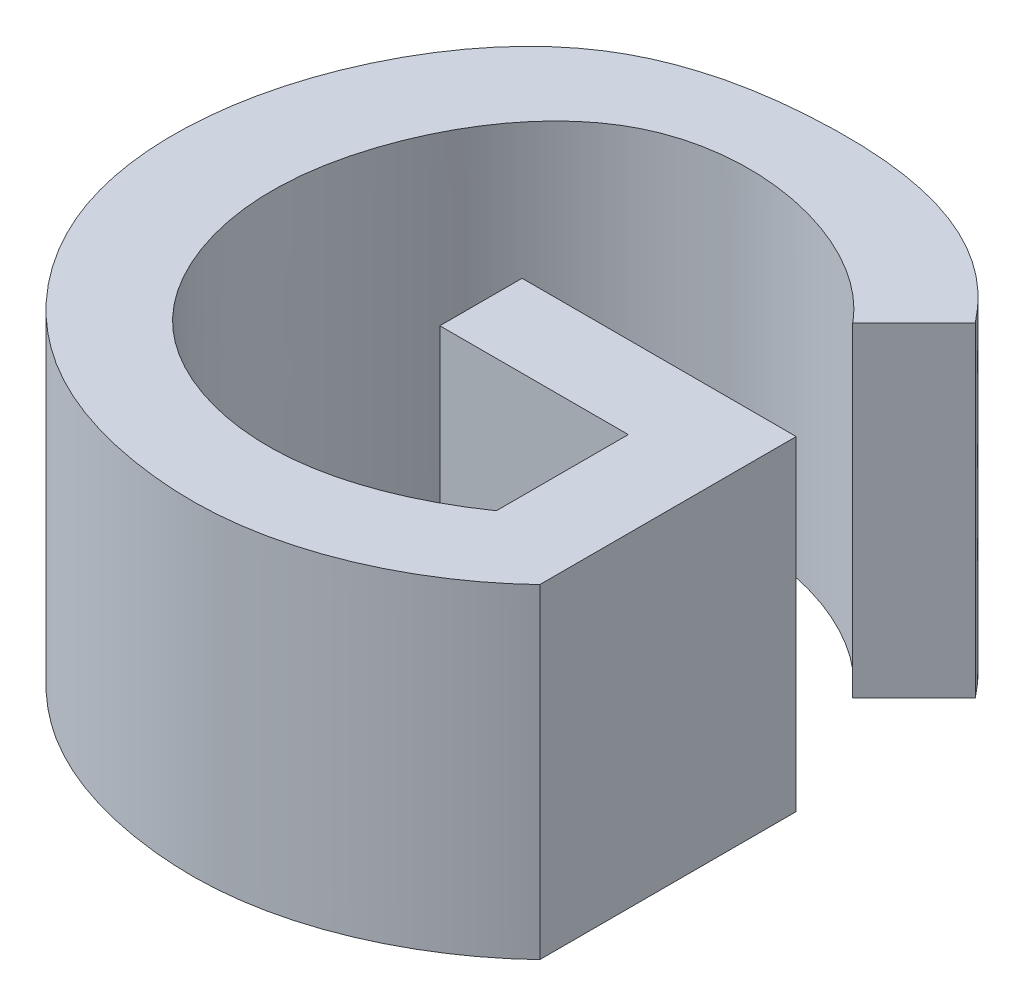
ISO-10303-21;
HEADER;
FILE_DESCRIPTION(('STEP AP214'),'2;1');
FILE_NAME('part.step','',(''),(''),'','','');
FILE_SCHEMA(('AUTOMOTIVE_DESIGN { 1 0 10303 214 1 1 1 1 }'));
ENDSEC;
DATA;
#1=APPLICATION_CONTEXT('core data for automotive mechanical design processes');
#2=APPLICATION_PROTOCOL_DEFINITION('international standard','automotive_design',2000,#1);
#3=PRODUCT_CONTEXT('',#1,'mechanical');
#4=PRODUCT('Part','Part','',(#3));
#5=PRODUCT_RELATED_PRODUCT_CATEGORY('part','',(#4));
#6=PRODUCT_DEFINITION_FORMATION('','',#4);
#7=PRODUCT_DEFINITION_CONTEXT('part definition',#1,'design');
#8=PRODUCT_DEFINITION('design','',#6,#7);
#9=PRODUCT_DEFINITION_SHAPE('','',#8);
#10=(LENGTH_UNIT() NAMED_UNIT(*) SI_UNIT(.MILLI.,.METRE.));
#11=(NAMED_UNIT(*) PLANE_ANGLE_UNIT() SI_UNIT($,.RADIAN.));
#12=(NAMED_UNIT(*) SI_UNIT($,.STERADIAN.) SOLID_ANGLE_UNIT());
#13=UNCERTAINTY_MEASURE_WITH_UNIT(LENGTH_MEASURE(1.E-05),#10,'distance_accuracy_value','');
#14=(GEOMETRIC_REPRESENTATION_CONTEXT(3) GLOBAL_UNCERTAINTY_ASSIGNED_CONTEXT((#13)) GLOBAL_UNIT_ASSIGNED_CONTEXT((#10,
#11,#12)) REPRESENTATION_CONTEXT('',''));
#15=CARTESIAN_POINT('',(0.,0.,0.));
#16=DIRECTION('',(0.,0.,1.));
#17=DIRECTION('',(1.,0.,0.));
#18=AXIS2_PLACEMENT_3D('',#15,#16,#17);
#19=CARTESIAN_POINT('',(296.149344439925,10.,-60.2562365635815));
#20=CARTESIAN_POINT('',(294.635244725944,10.,-59.2048276433993));
#21=CARTESIAN_POINT('',(291.165565492065,10.,-57.7919010808113));
#22=CARTESIAN_POINT('',(285.8243612232,10.,-59.6130976406927));
#23=CARTESIAN_POINT('',(283.912619752979,10.,-63.9996407660863));
#24=CARTESIAN_POINT('',(284.405746289499,10.,-68.6802438306113));
#25=CARTESIAN_POINT('',(288.233939982027,10.,-74.6612816437555));
#26=CARTESIAN_POINT('',(294.752597178449,10.,-73.0179646542755));
#27=CARTESIAN_POINT('',(296.62405706116,10.,-70.7531199206733));
#28=B_SPLINE_CURVE_WITH_KNOTS('',3,(#19,#20,#21,#22,#23,#24,#25,#26,#27),.UNSPECIFIED.,.F.,.F.,
(4,1,1,1,1,1,4),(0.,0.164827521055442,0.315061111689324,0.448478107291599,0.553523878175353,
0.73064871784689,1.),.UNSPECIFIED.);
#29=DIRECTION('',(0.,-1.,0.));
#30=VECTOR('',#29,1.);
#31=SURFACE_OF_LINEAR_EXTRUSION('',#28,#30);
#32=CARTESIAN_POINT('',(296.149344439925,0.,-60.2562365635815));
#33=CARTESIAN_POINT('',(294.635244725944,0.,-59.2048276433993));
#34=CARTESIAN_POINT('',(291.165565492065,0.,-57.7919010808113));
#35=CARTESIAN_POINT('',(285.8243612232,0.,-59.6130976406927));
#36=CARTESIAN_POINT('',(283.912619752979,0.,-63.9996407660863));
#37=CARTESIAN_POINT('',(284.405746289499,0.,-68.6802438306113));
#38=CARTESIAN_POINT('',(288.233939982027,0.,-74.6612816437555));
#39=CARTESIAN_POINT('',(294.752597178449,0.,-73.0179646542755));
#40=CARTESIAN_POINT('',(296.62405706116,0.,-70.7531199206733));
#41=B_SPLINE_CURVE_WITH_KNOTS('',3,(#32,#33,#34,#35,#36,#37,#38,#39,#40),.UNSPECIFIED.,.F.,.F.,
(4,1,1,1,1,1,4),(0.,0.164827521055442,0.315061111689324,0.448478107291599,0.553523878175353,
0.73064871784689,1.),.UNSPECIFIED.);
#42=CARTESIAN_POINT('',(296.149344439925,0.,-60.2562365635815));
#43=VERTEX_POINT('',#42);
#44=CARTESIAN_POINT('',(296.62405706116,0.,-70.7531199206733));
#45=VERTEX_POINT('',#44);
#46=EDGE_CURVE('E127',#43,#45,#41,.T.);
#47=ORIENTED_EDGE('',*,*,#46,.T.);
#48=DIRECTION('',(0.,-1.,0.));
#49=VECTOR('',#48,1.);
#50=CARTESIAN_POINT('',(296.62405706116,10.,-70.7531199206733));
#51=LINE('',#50,#49);
#52=CARTESIAN_POINT('',(296.62405706116,10.,-70.7531199206733));
#53=VERTEX_POINT('',#52);
#54=EDGE_CURVE('E11',#53,#45,#51,.T.);
#55=ORIENTED_EDGE('',*,*,#54,.F.);
#56=CARTESIAN_POINT('',(296.149344439925,10.,-60.2562365635815));
#57=VERTEX_POINT('',#56);
#58=EDGE_CURVE('E151',#57,#53,#28,.T.);
#59=ORIENTED_EDGE('',*,*,#58,.F.);
#60=DIRECTION('',(0.,-1.,0.));
#61=VECTOR('',#60,1.);
#62=CARTESIAN_POINT('',(296.149344439925,10.,-60.2562365635815));
#63=LINE('',#62,#61);
#64=EDGE_CURVE('E123',#57,#43,#63,.T.);
#65=ORIENTED_EDGE('',*,*,#64,.T.);
#66=EDGE_LOOP('',(#47,#55,#59,#65));
#67=FACE_BOUND('',#66,.T.);
#68=ADVANCED_FACE('F30',(#67),#31,.F.);
#69=CARTESIAN_POINT('',(296.62405706116,10.,-70.7531199206733));
#70=DIRECTION('',(-0.707106781186553,0.,-0.707106781186542));
#71=DIRECTION('',(-0.707106781186542,0.,0.707106781186553));
#72=AXIS2_PLACEMENT_3D('',#69,#70,#71);
#73=PLANE('',#72);
#74=DIRECTION('',(0.707106781186542,0.,-0.707106781186553));
#75=VECTOR('',#74,1.);
#76=CARTESIAN_POINT('',(296.62405706116,0.,-70.7531199206733));
#77=LINE('',#76,#75);
#78=CARTESIAN_POINT('',(298.51139214078,0.,-72.6404550002934));
#79=VERTEX_POINT('',#78);
#80=EDGE_CURVE('E132',#45,#79,#77,.T.);
#81=ORIENTED_EDGE('',*,*,#80,.T.);
#82=DIRECTION('',(0.,-1.,0.));
#83=VECTOR('',#82,1.);
#84=CARTESIAN_POINT('',(298.51139214078,10.,-72.6404550002934));
#85=LINE('',#84,#83);
#86=CARTESIAN_POINT('',(298.51139214078,10.,-72.6404550002934));
#87=VERTEX_POINT('',#86);
#88=EDGE_CURVE('E39',#87,#79,#85,.T.);
#89=ORIENTED_EDGE('',*,*,#88,.F.);
#90=DIRECTION('',(0.707106781186542,0.,-0.707106781186553));
#91=VECTOR('',#90,1.);
#92=CARTESIAN_POINT('',(296.62405706116,10.,-70.7531199206733));
#93=LINE('',#92,#91);
#94=EDGE_CURVE('E90',#53,#87,#93,.T.);
#95=ORIENTED_EDGE('',*,*,#94,.F.);
#96=ORIENTED_EDGE('',*,*,#54,.T.);
#97=EDGE_LOOP('',(#81,#89,#95,#96));
#98=FACE_BOUND('',#97,.T.);
#99=ADVANCED_FACE('F191',(#98),#73,.F.);
#100=CARTESIAN_POINT('',(298.51139214078,10.,-72.6404550002934));
#101=CARTESIAN_POINT('',(296.569905699759,10.,-75.1340630657013));
#102=CARTESIAN_POINT('',(291.962558255055,10.,-76.100955288035));
#103=CARTESIAN_POINT('',(285.36340704628,10.,-74.8408339160848));
#104=CARTESIAN_POINT('',(281.220754756846,10.,-69.5388788560056));
#105=CARTESIAN_POINT('',(280.533853014095,10.,-62.2671603593935));
#106=CARTESIAN_POINT('',(284.937879841703,10.,-57.1316917800918));
#107=CARTESIAN_POINT('',(289.020571628652,10.,-55.8972375236996));
#108=CARTESIAN_POINT('',(293.747339299983,10.,-55.7019912889211));
#109=CARTESIAN_POINT('',(296.954441687287,10.,-57.2112860334279));
#110=CARTESIAN_POINT('',(298.786636780122,10.,-58.9556493619376));
#111=B_SPLINE_CURVE_WITH_KNOTS('',3,(#100,#101,#102,#103,#104,#105,#106,#107,#108,#109,#110),
.UNSPECIFIED.,.F.,.F.,(4,1,1,1,1,1,1,1,4),(0.,0.176143569913615,0.291482052381995,
0.399920387261598,0.578021461310155,0.703191610119414,0.79298493184036,0.839736422370009,1.),.UNSPECIFIED.);
#112=DIRECTION('',(0.,-1.,0.));
#113=VECTOR('',#112,1.);
#114=SURFACE_OF_LINEAR_EXTRUSION('',#111,#113);
#115=CARTESIAN_POINT('',(298.51139214078,0.,-72.6404550002934));
#116=CARTESIAN_POINT('',(296.569905699759,0.,-75.1340630657013));
#117=CARTESIAN_POINT('',(291.962558255055,0.,-76.100955288035));
#118=CARTESIAN_POINT('',(285.36340704628,0.,-74.8408339160848));
#119=CARTESIAN_POINT('',(281.220754756846,0.,-69.5388788560056));
#120=CARTESIAN_POINT('',(280.533853014095,0.,-62.2671603593935));
#121=CARTESIAN_POINT('',(284.937879841703,0.,-57.1316917800918));
#122=CARTESIAN_POINT('',(289.020571628652,0.,-55.8972375236996));
#123=CARTESIAN_POINT('',(293.747339299983,0.,-55.7019912889211));
#124=CARTESIAN_POINT('',(296.954441687287,0.,-57.2112860334279));
#125=CARTESIAN_POINT('',(298.786636780122,0.,-58.9556493619376));
#126=B_SPLINE_CURVE_WITH_KNOTS('',3,(#115,#116,#117,#118,#119,#120,#121,#122,#123,#124,#125),
.UNSPECIFIED.,.F.,.F.,(4,1,1,1,1,1,1,1,4),(0.,0.176143569913615,0.291482052381995,
0.399920387261598,0.578021461310155,0.703191610119414,0.79298493184036,0.839736422370009,1.),.UNSPECIFIED.);
#127=CARTESIAN_POINT('',(298.786636780122,0.,-58.9556493619376));
#128=VERTEX_POINT('',#127);
#129=EDGE_CURVE('E137',#79,#128,#126,.T.);
#130=ORIENTED_EDGE('',*,*,#129,.T.);
#131=DIRECTION('',(0.,-1.,0.));
#132=VECTOR('',#131,1.);
#133=CARTESIAN_POINT('',(298.786636780122,10.,-58.9556493619376));
#134=LINE('',#133,#132);
#135=CARTESIAN_POINT('',(298.786636780122,10.,-58.9556493619376));
#136=VERTEX_POINT('',#135);
#137=EDGE_CURVE('E158',#136,#128,#134,.T.);
#138=ORIENTED_EDGE('',*,*,#137,.F.);
#139=EDGE_CURVE('E166',#87,#136,#111,.T.);
#140=ORIENTED_EDGE('',*,*,#139,.F.);
#141=ORIENTED_EDGE('',*,*,#88,.T.);
#142=EDGE_LOOP('',(#130,#138,#140,#141));
#143=FACE_BOUND('',#142,.T.);
#144=ADVANCED_FACE('F164',(#143),#114,.F.);
#145=CARTESIAN_POINT('',(298.786636780122,10.,-66.8499272571826));
#146=DIRECTION('',(-1.,0.,0.));
#147=DIRECTION('',(0.,0.,1.));
#148=AXIS2_PLACEMENT_3D('',#145,#146,#147);
#149=PLANE('',#148);
#150=DIRECTION('',(0.,0.,-1.));
#151=VECTOR('',#150,1.);
#152=CARTESIAN_POINT('',(298.786636780122,0.,-66.8499272571826));
#153=LINE('',#152,#151);
#154=CARTESIAN_POINT('',(298.786636780122,0.,-66.8499272571826));
#155=VERTEX_POINT('',#154);
#156=EDGE_CURVE('E141',#128,#155,#153,.T.);
#157=ORIENTED_EDGE('',*,*,#156,.T.);
#158=DIRECTION('',(0.,-1.,0.));
#159=VECTOR('',#158,1.);
#160=CARTESIAN_POINT('',(298.786636780122,10.,-66.8499272571826));
#161=LINE('',#160,#159);
#162=CARTESIAN_POINT('',(298.786636780122,10.,-66.8499272571826));
#163=VERTEX_POINT('',#162);
#164=EDGE_CURVE('E155',#163,#155,#161,.T.);
#165=ORIENTED_EDGE('',*,*,#164,.F.);
#166=DIRECTION('',(0.,0.,-1.));
#167=VECTOR('',#166,1.);
#168=CARTESIAN_POINT('',(298.786636780122,10.,-66.8499272571826));
#169=LINE('',#168,#167);
#170=EDGE_CURVE('E178',#136,#163,#169,.T.);
#171=ORIENTED_EDGE('',*,*,#170,.F.);
#172=ORIENTED_EDGE('',*,*,#137,.T.);
#173=EDGE_LOOP('',(#157,#165,#171,#172));
#174=FACE_BOUND('',#173,.T.);
#175=ADVANCED_FACE('F174',(#174),#149,.F.);
#176=CARTESIAN_POINT('',(290.347301291493,10.,-66.8499272571826));
#177=DIRECTION('',(0.,0.,1.));
#178=DIRECTION('',(1.,0.,0.));
#179=AXIS2_PLACEMENT_3D('',#176,#177,#178);
#180=PLANE('',#179);
#181=DIRECTION('',(-1.,0.,0.));
#182=VECTOR('',#181,1.);
#183=CARTESIAN_POINT('',(290.347301291493,0.,-66.8499272571826));
#184=LINE('',#183,#182);
#185=CARTESIAN_POINT('',(290.347301291493,0.,-66.8499272571826));
#186=VERTEX_POINT('',#185);
#187=EDGE_CURVE('E146',#155,#186,#184,.T.);
#188=ORIENTED_EDGE('',*,*,#187,.T.);
#189=DIRECTION('',(0.,-1.,0.));
#190=VECTOR('',#189,1.);
#191=CARTESIAN_POINT('',(290.347301291493,10.,-66.8499272571826));
#192=LINE('',#191,#190);
#193=CARTESIAN_POINT('',(290.347301291493,10.,-66.8499272571826));
#194=VERTEX_POINT('',#193);
#195=EDGE_CURVE('E118',#194,#186,#192,.T.);
#196=ORIENTED_EDGE('',*,*,#195,.F.);
#197=DIRECTION('',(-1.,0.,0.));
#198=VECTOR('',#197,1.);
#199=CARTESIAN_POINT('',(290.347301291493,10.,-66.8499272571826));
#200=LINE('',#199,#198);
#201=EDGE_CURVE('E109',#163,#194,#200,.T.);
#202=ORIENTED_EDGE('',*,*,#201,.F.);
#203=ORIENTED_EDGE('',*,*,#164,.T.);
#204=EDGE_LOOP('',(#188,#196,#202,#203));
#205=FACE_BOUND('',#204,.T.);
#206=ADVANCED_FACE('F177',(#205),#180,.F.);
#207=CARTESIAN_POINT('',(290.347301291493,10.,-64.3181266105941));
#208=DIRECTION('',(1.,0.,0.));
#209=DIRECTION('',(0.,0.,-1.));
#210=AXIS2_PLACEMENT_3D('',#207,#208,#209);
#211=PLANE('',#210);
#212=DIRECTION('',(0.,0.,1.));
#213=VECTOR('',#212,1.);
#214=CARTESIAN_POINT('',(290.347301291493,0.,-64.3181266105941));
#215=LINE('',#214,#213);
#216=CARTESIAN_POINT('',(290.347301291493,0.,-64.3181266105941));
#217=VERTEX_POINT('',#216);
#218=EDGE_CURVE('E117',#186,#217,#215,.T.);
#219=ORIENTED_EDGE('',*,*,#218,.T.);
#220=DIRECTION('',(0.,-1.,0.));
#221=VECTOR('',#220,1.);
#222=CARTESIAN_POINT('',(290.347301291493,10.,-64.3181266105941));
#223=LINE('',#222,#221);
#224=CARTESIAN_POINT('',(290.347301291493,10.,-64.3181266105941));
#225=VERTEX_POINT('',#224);
#226=EDGE_CURVE('E114',#225,#217,#223,.T.);
#227=ORIENTED_EDGE('',*,*,#226,.F.);
#228=DIRECTION('',(0.,0.,1.));
#229=VECTOR('',#228,1.);
#230=CARTESIAN_POINT('',(290.347301291493,10.,-64.3181266105941));
#231=LINE('',#230,#229);
#232=EDGE_CURVE('E103',#194,#225,#231,.T.);
#233=ORIENTED_EDGE('',*,*,#232,.F.);
#234=ORIENTED_EDGE('',*,*,#195,.T.);
#235=EDGE_LOOP('',(#219,#227,#233,#234));
#236=FACE_BOUND('',#235,.T.);
#237=ADVANCED_FACE('F115',(#236),#211,.F.);
#238=CARTESIAN_POINT('',(296.149344439925,10.,-64.3181266105941));
#239=DIRECTION('',(0.,0.,-1.));
#240=DIRECTION('',(-1.,0.,0.));
#241=AXIS2_PLACEMENT_3D('',#238,#239,#240);
#242=PLANE('',#241);
#243=DIRECTION('',(1.,0.,0.));
#244=VECTOR('',#243,1.);
#245=CARTESIAN_POINT('',(296.149344439925,0.,-64.3181266105941));
#246=LINE('',#245,#244);
#247=CARTESIAN_POINT('',(296.149344439925,0.,-64.3181266105941));
#248=VERTEX_POINT('',#247);
#249=EDGE_CURVE('E76',#217,#248,#246,.T.);
#250=ORIENTED_EDGE('',*,*,#249,.T.);
#251=DIRECTION('',(0.,-1.,0.));
#252=VECTOR('',#251,1.);
#253=CARTESIAN_POINT('',(296.149344439925,10.,-64.3181266105941));
#254=LINE('',#253,#252);
#255=CARTESIAN_POINT('',(296.149344439925,10.,-64.3181266105941));
#256=VERTEX_POINT('',#255);
#257=EDGE_CURVE('E119',#256,#248,#254,.T.);
#258=ORIENTED_EDGE('',*,*,#257,.F.);
#259=DIRECTION('',(1.,0.,0.));
#260=VECTOR('',#259,1.);
#261=CARTESIAN_POINT('',(296.149344439925,10.,-64.3181266105941));
#262=LINE('',#261,#260);
#263=EDGE_CURVE('E107',#225,#256,#262,.T.);
#264=ORIENTED_EDGE('',*,*,#263,.F.);
#265=ORIENTED_EDGE('',*,*,#226,.T.);
#266=EDGE_LOOP('',(#250,#258,#264,#265));
#267=FACE_BOUND('',#266,.T.);
#268=ADVANCED_FACE('F121',(#267),#242,.F.);
#269=CARTESIAN_POINT('',(296.149344439925,10.,-60.2562365635815));
#270=DIRECTION('',(1.,0.,0.));
#271=DIRECTION('',(0.,0.,-1.));
#272=AXIS2_PLACEMENT_3D('',#269,#270,#271);
#273=PLANE('',#272);
#274=DIRECTION('',(0.,0.,1.));
#275=VECTOR('',#274,1.);
#276=CARTESIAN_POINT('',(296.149344439925,0.,-60.2562365635815));
#277=LINE('',#276,#275);
#278=EDGE_CURVE('E82',#248,#43,#277,.T.);
#279=ORIENTED_EDGE('',*,*,#278,.T.);
#280=ORIENTED_EDGE('',*,*,#64,.F.);
#281=DIRECTION('',(0.,0.,1.));
#282=VECTOR('',#281,1.);
#283=CARTESIAN_POINT('',(296.149344439925,10.,-60.2562365635815));
#284=LINE('',#283,#282);
#285=EDGE_CURVE('E47',#256,#57,#284,.T.);
#286=ORIENTED_EDGE('',*,*,#285,.F.);
#287=ORIENTED_EDGE('',*,*,#257,.T.);
#288=EDGE_LOOP('',(#279,#280,#286,#287));
#289=FACE_BOUND('',#288,.T.);
#290=ADVANCED_FACE('F200',(#289),#273,.F.);
#291=CARTESIAN_POINT('',(284.193610470897,10.,-66.0579212090243));
#292=DIRECTION('',(0.,-1.,0.));
#293=DIRECTION('',(0.,0.,-1.));
#294=AXIS2_PLACEMENT_3D('',#291,#292,#293);
#295=PLANE('',#294);
#296=ORIENTED_EDGE('',*,*,#58,.T.);
#297=ORIENTED_EDGE('',*,*,#94,.T.);
#298=ORIENTED_EDGE('',*,*,#139,.T.);
#299=ORIENTED_EDGE('',*,*,#170,.T.);
#300=ORIENTED_EDGE('',*,*,#201,.T.);
#301=ORIENTED_EDGE('',*,*,#232,.T.);
#302=ORIENTED_EDGE('',*,*,#263,.T.);
#303=ORIENTED_EDGE('',*,*,#285,.T.);
#304=EDGE_LOOP('',(#296,#297,#298,#299,#300,#301,#302,#303));
#305=FACE_BOUND('',#304,.T.);
#306=ADVANCED_FACE('F105',(#305),#295,.F.);
#307=CARTESIAN_POINT('',(284.193610470897,0.,-66.0579212090243));
#308=DIRECTION('',(0.,-1.,0.));
#309=DIRECTION('',(0.,0.,-1.));
#310=AXIS2_PLACEMENT_3D('',#307,#308,#309);
#311=PLANE('',#310);
#312=ORIENTED_EDGE('',*,*,#46,.F.);
#313=ORIENTED_EDGE('',*,*,#278,.F.);
#314=ORIENTED_EDGE('',*,*,#249,.F.);
#315=ORIENTED_EDGE('',*,*,#218,.F.);
#316=ORIENTED_EDGE('',*,*,#187,.F.);
#317=ORIENTED_EDGE('',*,*,#156,.F.);
#318=ORIENTED_EDGE('',*,*,#129,.F.);
#319=ORIENTED_EDGE('',*,*,#80,.F.);
#320=EDGE_LOOP('',(#312,#313,#314,#315,#316,#317,#318,#319));
#321=FACE_BOUND('',#320,.T.);
#322=ADVANCED_FACE('F170',(#321),#311,.T.);
#323=CLOSED_SHELL('',(#68,#99,#144,#175,#206,#237,#268,#290,#306,#322));
#324=MANIFOLD_SOLID_BREP('B2',#323);
#325=ADVANCED_BREP_SHAPE_REPRESENTATION('',(#18,#324),#14);
#326=SHAPE_DEFINITION_REPRESENTATION(#9,#325);
ENDSEC;
END-ISO-10303-21;
